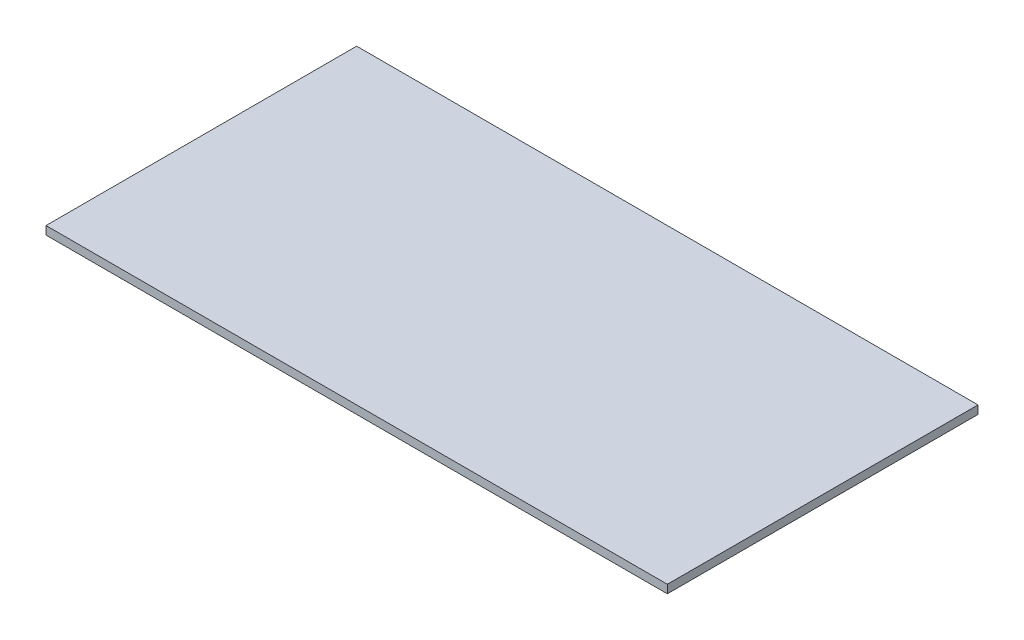
ISO-10303-21;
HEADER;
FILE_DESCRIPTION(('STEP AP214'),'2;1');
FILE_NAME('part.step','',(''),(''),'','','');
FILE_SCHEMA(('AUTOMOTIVE_DESIGN { 1 0 10303 214 1 1 1 1 }'));
ENDSEC;
DATA;
#1=APPLICATION_CONTEXT('core data for automotive mechanical design processes');
#2=APPLICATION_PROTOCOL_DEFINITION('international standard','automotive_design',2000,#1);
#3=PRODUCT_CONTEXT('',#1,'mechanical');
#4=PRODUCT('Part','Part','',(#3));
#5=PRODUCT_RELATED_PRODUCT_CATEGORY('part','',(#4));
#6=PRODUCT_DEFINITION_FORMATION('','',#4);
#7=PRODUCT_DEFINITION_CONTEXT('part definition',#1,'design');
#8=PRODUCT_DEFINITION('design','',#6,#7);
#9=PRODUCT_DEFINITION_SHAPE('','',#8);
#10=(LENGTH_UNIT() NAMED_UNIT(*) SI_UNIT(.MILLI.,.METRE.));
#11=(NAMED_UNIT(*) PLANE_ANGLE_UNIT() SI_UNIT($,.RADIAN.));
#12=(NAMED_UNIT(*) SI_UNIT($,.STERADIAN.) SOLID_ANGLE_UNIT());
#13=UNCERTAINTY_MEASURE_WITH_UNIT(LENGTH_MEASURE(1.E-05),#10,'distance_accuracy_value','');
#14=(GEOMETRIC_REPRESENTATION_CONTEXT(3) GLOBAL_UNCERTAINTY_ASSIGNED_CONTEXT((#13)) GLOBAL_UNIT_ASSIGNED_CONTEXT((#10,
#11,#12)) REPRESENTATION_CONTEXT('',''));
#15=CARTESIAN_POINT('',(0.,0.,0.));
#16=DIRECTION('',(0.,0.,1.));
#17=DIRECTION('',(1.,0.,0.));
#18=AXIS2_PLACEMENT_3D('',#15,#16,#17);
#19=CARTESIAN_POINT('',(750.,20.,375.));
#20=DIRECTION('',(-1.,0.,0.));
#21=DIRECTION('',(0.,0.,1.));
#22=AXIS2_PLACEMENT_3D('',#19,#20,#21);
#23=PLANE('',#22);
#24=DIRECTION('',(0.,0.,-1.));
#25=VECTOR('',#24,1.);
#26=CARTESIAN_POINT('',(750.,0.,375.));
#27=LINE('',#26,#25);
#28=CARTESIAN_POINT('',(750.,0.,375.));
#29=VERTEX_POINT('',#28);
#30=CARTESIAN_POINT('',(750.,0.,-375.));
#31=VERTEX_POINT('',#30);
#32=EDGE_CURVE('E107',#29,#31,#27,.T.);
#33=ORIENTED_EDGE('',*,*,#32,.T.);
#34=DIRECTION('',(0.,-1.,0.));
#35=VECTOR('',#34,1.);
#36=CARTESIAN_POINT('',(750.,20.,-375.));
#37=LINE('',#36,#35);
#38=CARTESIAN_POINT('',(750.,20.,-375.));
#39=VERTEX_POINT('',#38);
#40=EDGE_CURVE('E11',#39,#31,#37,.T.);
#41=ORIENTED_EDGE('',*,*,#40,.F.);
#42=DIRECTION('',(0.,0.,-1.));
#43=VECTOR('',#42,1.);
#44=CARTESIAN_POINT('',(750.,20.,375.));
#45=LINE('',#44,#43);
#46=CARTESIAN_POINT('',(750.,20.,375.));
#47=VERTEX_POINT('',#46);
#48=EDGE_CURVE('E91',#47,#39,#45,.T.);
#49=ORIENTED_EDGE('',*,*,#48,.F.);
#50=DIRECTION('',(0.,-1.,0.));
#51=VECTOR('',#50,1.);
#52=CARTESIAN_POINT('',(750.,20.,375.));
#53=LINE('',#52,#51);
#54=EDGE_CURVE('E103',#47,#29,#53,.T.);
#55=ORIENTED_EDGE('',*,*,#54,.T.);
#56=EDGE_LOOP('',(#33,#41,#49,#55));
#57=FACE_BOUND('',#56,.T.);
#58=ADVANCED_FACE('F39',(#57),#23,.F.);
#59=CARTESIAN_POINT('',(-750.,20.,-375.));
#60=DIRECTION('',(0.,0.,1.));
#61=DIRECTION('',(1.,0.,0.));
#62=AXIS2_PLACEMENT_3D('',#59,#60,#61);
#63=PLANE('',#62);
#64=DIRECTION('',(-1.,0.,0.));
#65=VECTOR('',#64,1.);
#66=CARTESIAN_POINT('',(-750.,0.,-375.));
#67=LINE('',#66,#65);
#68=CARTESIAN_POINT('',(-750.,0.,-375.));
#69=VERTEX_POINT('',#68);
#70=EDGE_CURVE('E96',#31,#69,#67,.T.);
#71=ORIENTED_EDGE('',*,*,#70,.T.);
#72=DIRECTION('',(0.,-1.,0.));
#73=VECTOR('',#72,1.);
#74=CARTESIAN_POINT('',(-750.,20.,-375.));
#75=LINE('',#74,#73);
#76=CARTESIAN_POINT('',(-750.,20.,-375.));
#77=VERTEX_POINT('',#76);
#78=EDGE_CURVE('E48',#77,#69,#75,.T.);
#79=ORIENTED_EDGE('',*,*,#78,.F.);
#80=DIRECTION('',(-1.,0.,0.));
#81=VECTOR('',#80,1.);
#82=CARTESIAN_POINT('',(-750.,20.,-375.));
#83=LINE('',#82,#81);
#84=EDGE_CURVE('E86',#39,#77,#83,.T.);
#85=ORIENTED_EDGE('',*,*,#84,.F.);
#86=ORIENTED_EDGE('',*,*,#40,.T.);
#87=EDGE_LOOP('',(#71,#79,#85,#86));
#88=FACE_BOUND('',#87,.T.);
#89=ADVANCED_FACE('F95',(#88),#63,.F.);
#90=CARTESIAN_POINT('',(-750.,20.,375.));
#91=DIRECTION('',(1.,0.,0.));
#92=DIRECTION('',(0.,0.,-1.));
#93=AXIS2_PLACEMENT_3D('',#90,#91,#92);
#94=PLANE('',#93);
#95=DIRECTION('',(0.,0.,1.));
#96=VECTOR('',#95,1.);
#97=CARTESIAN_POINT('',(-750.,0.,375.));
#98=LINE('',#97,#96);
#99=CARTESIAN_POINT('',(-750.,0.,375.));
#100=VERTEX_POINT('',#99);
#101=EDGE_CURVE('E73',#69,#100,#98,.T.);
#102=ORIENTED_EDGE('',*,*,#101,.T.);
#103=DIRECTION('',(0.,-1.,0.));
#104=VECTOR('',#103,1.);
#105=CARTESIAN_POINT('',(-750.,20.,375.));
#106=LINE('',#105,#104);
#107=CARTESIAN_POINT('',(-750.,20.,375.));
#108=VERTEX_POINT('',#107);
#109=EDGE_CURVE('E98',#108,#100,#106,.T.);
#110=ORIENTED_EDGE('',*,*,#109,.F.);
#111=DIRECTION('',(0.,0.,1.));
#112=VECTOR('',#111,1.);
#113=CARTESIAN_POINT('',(-750.,20.,375.));
#114=LINE('',#113,#112);
#115=EDGE_CURVE('E89',#77,#108,#114,.T.);
#116=ORIENTED_EDGE('',*,*,#115,.F.);
#117=ORIENTED_EDGE('',*,*,#78,.T.);
#118=EDGE_LOOP('',(#102,#110,#116,#117));
#119=FACE_BOUND('',#118,.T.);
#120=ADVANCED_FACE('F99',(#119),#94,.F.);
#121=CARTESIAN_POINT('',(-750.,20.,375.));
#122=DIRECTION('',(0.,0.,-1.));
#123=DIRECTION('',(-1.,0.,0.));
#124=AXIS2_PLACEMENT_3D('',#121,#122,#123);
#125=PLANE('',#124);
#126=DIRECTION('',(1.,0.,0.));
#127=VECTOR('',#126,1.);
#128=CARTESIAN_POINT('',(-750.,0.,375.));
#129=LINE('',#128,#127);
#130=EDGE_CURVE('E79',#100,#29,#129,.T.);
#131=ORIENTED_EDGE('',*,*,#130,.T.);
#132=ORIENTED_EDGE('',*,*,#54,.F.);
#133=DIRECTION('',(1.,0.,0.));
#134=VECTOR('',#133,1.);
#135=CARTESIAN_POINT('',(-750.,20.,375.));
#136=LINE('',#135,#134);
#137=EDGE_CURVE('E56',#108,#47,#136,.T.);
#138=ORIENTED_EDGE('',*,*,#137,.F.);
#139=ORIENTED_EDGE('',*,*,#109,.T.);
#140=EDGE_LOOP('',(#131,#132,#138,#139));
#141=FACE_BOUND('',#140,.T.);
#142=ADVANCED_FACE('F120',(#141),#125,.F.);
#143=CARTESIAN_POINT('',(0.,20.,0.));
#144=DIRECTION('',(0.,-1.,0.));
#145=DIRECTION('',(0.,0.,-1.));
#146=AXIS2_PLACEMENT_3D('',#143,#144,#145);
#147=PLANE('',#146);
#148=ORIENTED_EDGE('',*,*,#48,.T.);
#149=ORIENTED_EDGE('',*,*,#84,.T.);
#150=ORIENTED_EDGE('',*,*,#115,.T.);
#151=ORIENTED_EDGE('',*,*,#137,.T.);
#152=EDGE_LOOP('',(#148,#149,#150,#151));
#153=FACE_BOUND('',#152,.T.);
#154=ADVANCED_FACE('F87',(#153),#147,.F.);
#155=CARTESIAN_POINT('',(0.,0.,0.));
#156=DIRECTION('',(0.,-1.,0.));
#157=DIRECTION('',(0.,0.,-1.));
#158=AXIS2_PLACEMENT_3D('',#155,#156,#157);
#159=PLANE('',#158);
#160=ORIENTED_EDGE('',*,*,#32,.F.);
#161=ORIENTED_EDGE('',*,*,#130,.F.);
#162=ORIENTED_EDGE('',*,*,#101,.F.);
#163=ORIENTED_EDGE('',*,*,#70,.F.);
#164=EDGE_LOOP('',(#160,#161,#162,#163));
#165=FACE_BOUND('',#164,.T.);
#166=ADVANCED_FACE('F123',(#165),#159,.T.);
#167=CLOSED_SHELL('',(#58,#89,#120,#142,#154,#166));
#168=MANIFOLD_SOLID_BREP('B2',#167);
#169=ADVANCED_BREP_SHAPE_REPRESENTATION('',(#18,#168),#14);
#170=SHAPE_DEFINITION_REPRESENTATION(#9,#169);
ENDSEC;
END-ISO-10303-21;
